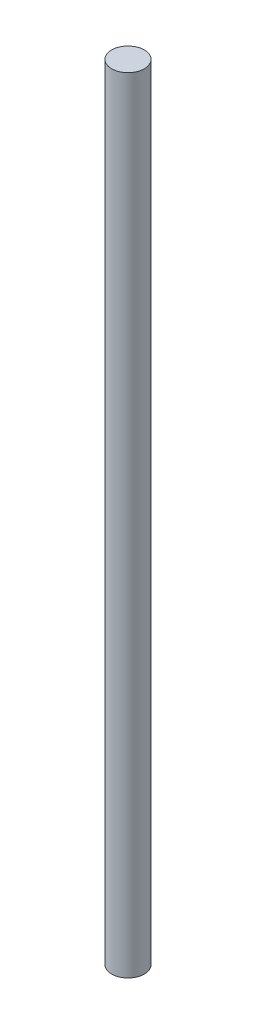
ISO-10303-21;
HEADER;
FILE_DESCRIPTION(('STEP AP214'),'2;1');
FILE_NAME('part.step','',(''),(''),'','','');
FILE_SCHEMA(('AUTOMOTIVE_DESIGN { 1 0 10303 214 1 1 1 1 }'));
ENDSEC;
DATA;
#1=APPLICATION_CONTEXT('core data for automotive mechanical design processes');
#2=APPLICATION_PROTOCOL_DEFINITION('international standard','automotive_design',2000,#1);
#3=PRODUCT_CONTEXT('',#1,'mechanical');
#4=PRODUCT('Part','Part','',(#3));
#5=PRODUCT_RELATED_PRODUCT_CATEGORY('part','',(#4));
#6=PRODUCT_DEFINITION_FORMATION('','',#4);
#7=PRODUCT_DEFINITION_CONTEXT('part definition',#1,'design');
#8=PRODUCT_DEFINITION('design','',#6,#7);
#9=PRODUCT_DEFINITION_SHAPE('','',#8);
#10=(LENGTH_UNIT() NAMED_UNIT(*) SI_UNIT(.MILLI.,.METRE.));
#11=(NAMED_UNIT(*) PLANE_ANGLE_UNIT() SI_UNIT($,.RADIAN.));
#12=(NAMED_UNIT(*) SI_UNIT($,.STERADIAN.) SOLID_ANGLE_UNIT());
#13=UNCERTAINTY_MEASURE_WITH_UNIT(LENGTH_MEASURE(1.E-05),#10,'distance_accuracy_value','');
#14=(GEOMETRIC_REPRESENTATION_CONTEXT(3) GLOBAL_UNCERTAINTY_ASSIGNED_CONTEXT((#13)) GLOBAL_UNIT_ASSIGNED_CONTEXT((#10,
#11,#12)) REPRESENTATION_CONTEXT('',''));
#15=CARTESIAN_POINT('',(0.,0.,0.));
#16=DIRECTION('',(0.,0.,1.));
#17=DIRECTION('',(1.,0.,0.));
#18=AXIS2_PLACEMENT_3D('',#15,#16,#17);
#19=CARTESIAN_POINT('',(0.,152.4,0.));
#20=DIRECTION('',(0.,-1.,0.));
#21=DIRECTION('',(0.,0.,-1.));
#22=AXIS2_PLACEMENT_3D('',#19,#20,#21);
#23=CYLINDRICAL_SURFACE('',#22,3.175);
#24=CARTESIAN_POINT('',(0.,152.4,0.));
#25=DIRECTION('',(0.,1.,0.));
#26=DIRECTION('',(0.,0.,1.));
#27=AXIS2_PLACEMENT_3D('',#24,#25,#26);
#28=CIRCLE('',#27,3.175);
#29=CARTESIAN_POINT('',(0.,152.4,3.175));
#30=VERTEX_POINT('',#29);
#31=EDGE_CURVE('E10',#30,#30,#28,.T.);
#32=ORIENTED_EDGE('',*,*,#31,.F.);
#33=EDGE_LOOP('',(#32));
#34=FACE_BOUND('',#33,.T.);
#35=CARTESIAN_POINT('',(0.,0.,0.));
#36=DIRECTION('',(0.,1.,0.));
#37=DIRECTION('',(0.,0.,1.));
#38=AXIS2_PLACEMENT_3D('',#35,#36,#37);
#39=CIRCLE('',#38,3.175);
#40=CARTESIAN_POINT('',(0.,0.,3.175));
#41=VERTEX_POINT('',#40);
#42=EDGE_CURVE('E34',#41,#41,#39,.T.);
#43=ORIENTED_EDGE('',*,*,#42,.T.);
#44=EDGE_LOOP('',(#43));
#45=FACE_BOUND('',#44,.T.);
#46=ADVANCED_FACE('F31',(#34,#45),#23,.T.);
#47=CARTESIAN_POINT('',(0.,152.4,0.));
#48=DIRECTION('',(0.,1.,0.));
#49=DIRECTION('',(0.,0.,1.));
#50=AXIS2_PLACEMENT_3D('',#47,#48,#49);
#51=PLANE('',#50);
#52=ORIENTED_EDGE('',*,*,#31,.T.);
#53=EDGE_LOOP('',(#52));
#54=FACE_BOUND('',#53,.T.);
#55=ADVANCED_FACE('F46',(#54),#51,.T.);
#56=CARTESIAN_POINT('',(0.,0.,0.));
#57=DIRECTION('',(0.,1.,0.));
#58=DIRECTION('',(0.,0.,1.));
#59=AXIS2_PLACEMENT_3D('',#56,#57,#58);
#60=PLANE('',#59);
#61=ORIENTED_EDGE('',*,*,#42,.F.);
#62=EDGE_LOOP('',(#61));
#63=FACE_BOUND('',#62,.T.);
#64=ADVANCED_FACE('F44',(#63),#60,.F.);
#65=CLOSED_SHELL('',(#46,#55,#64));
#66=MANIFOLD_SOLID_BREP('B2',#65);
#67=ADVANCED_BREP_SHAPE_REPRESENTATION('',(#18,#66),#14);
#68=SHAPE_DEFINITION_REPRESENTATION(#9,#67);
ENDSEC;
END-ISO-10303-21;
